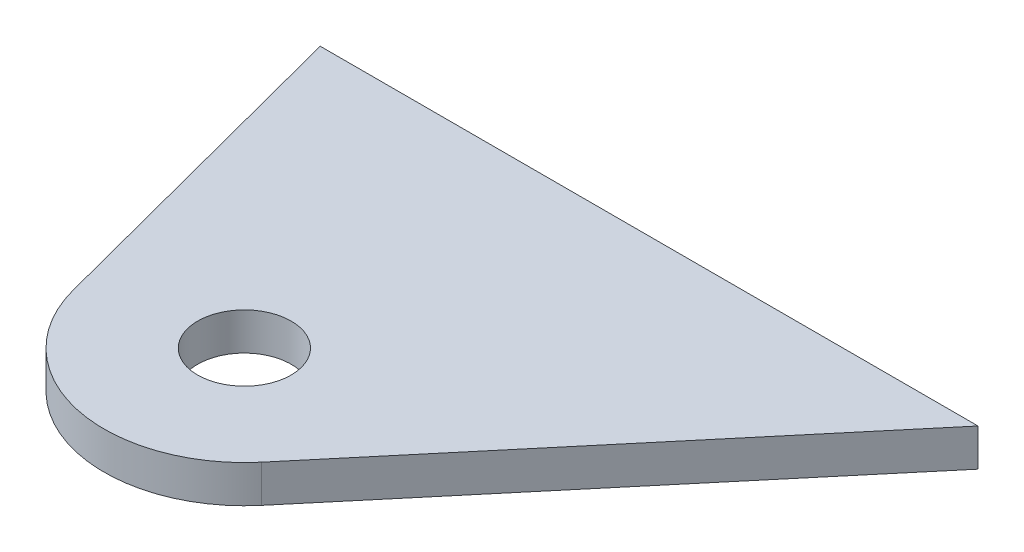
ISO-10303-21;
HEADER;
FILE_DESCRIPTION(('STEP AP214'),'2;1');
FILE_NAME('part.step','',(''),(''),'','','');
FILE_SCHEMA(('AUTOMOTIVE_DESIGN { 1 0 10303 214 1 1 1 1 }'));
ENDSEC;
DATA;
#1=APPLICATION_CONTEXT('core data for automotive mechanical design processes');
#2=APPLICATION_PROTOCOL_DEFINITION('international standard','automotive_design',2000,#1);
#3=PRODUCT_CONTEXT('',#1,'mechanical');
#4=PRODUCT('Part','Part','',(#3));
#5=PRODUCT_RELATED_PRODUCT_CATEGORY('part','',(#4));
#6=PRODUCT_DEFINITION_FORMATION('','',#4);
#7=PRODUCT_DEFINITION_CONTEXT('part definition',#1,'design');
#8=PRODUCT_DEFINITION('design','',#6,#7);
#9=PRODUCT_DEFINITION_SHAPE('','',#8);
#10=(LENGTH_UNIT() NAMED_UNIT(*) SI_UNIT(.MILLI.,.METRE.));
#11=(NAMED_UNIT(*) PLANE_ANGLE_UNIT() SI_UNIT($,.RADIAN.));
#12=(NAMED_UNIT(*) SI_UNIT($,.STERADIAN.) SOLID_ANGLE_UNIT());
#13=UNCERTAINTY_MEASURE_WITH_UNIT(LENGTH_MEASURE(1.E-05),#10,'distance_accuracy_value','');
#14=(GEOMETRIC_REPRESENTATION_CONTEXT(3) GLOBAL_UNCERTAINTY_ASSIGNED_CONTEXT((#13)) GLOBAL_UNIT_ASSIGNED_CONTEXT((#10,
#11,#12)) REPRESENTATION_CONTEXT('',''));
#15=CARTESIAN_POINT('',(0.,0.,0.));
#16=DIRECTION('',(0.,0.,1.));
#17=DIRECTION('',(1.,0.,0.));
#18=AXIS2_PLACEMENT_3D('',#15,#16,#17);
#19=CARTESIAN_POINT('',(-874.000588100556,354.33,-733.373571123904));
#20=DIRECTION('',(0.766044443118978,0.,0.64278760968654));
#21=DIRECTION('',(0.64278760968654,0.,-0.766044443118978));
#22=AXIS2_PLACEMENT_3D('',#19,#20,#21);
#23=PLANE('',#22);
#24=DIRECTION('',(-0.64278760968654,0.,0.766044443118978));
#25=VECTOR('',#24,1.);
#26=CARTESIAN_POINT('',(-874.000588100556,351.79,-733.373571123904));
#27=LINE('',#26,#25);
#28=CARTESIAN_POINT('',(-1621.51549106359,351.79,157.48));
#29=VERTEX_POINT('',#28);
#30=CARTESIAN_POINT('',(-1643.70342667929,351.79,183.922551982264));
#31=VERTEX_POINT('',#30);
#32=EDGE_CURVE('E107',#29,#31,#27,.T.);
#33=ORIENTED_EDGE('',*,*,#32,.F.);
#34=DIRECTION('',(0.,-1.,0.));
#35=VECTOR('',#34,1.);
#36=CARTESIAN_POINT('',(-1621.51549106359,354.33,157.48));
#37=LINE('',#36,#35);
#38=CARTESIAN_POINT('',(-1621.51549106359,354.33,157.48));
#39=VERTEX_POINT('',#38);
#40=EDGE_CURVE('E11',#39,#29,#37,.T.);
#41=ORIENTED_EDGE('',*,*,#40,.F.);
#42=DIRECTION('',(-0.64278760968654,0.,0.766044443118978));
#43=VECTOR('',#42,1.);
#44=CARTESIAN_POINT('',(-874.000588100556,354.33,-733.373571123904));
#45=LINE('',#44,#43);
#46=CARTESIAN_POINT('',(-1643.70342667929,354.33,183.922551982264));
#47=VERTEX_POINT('',#46);
#48=EDGE_CURVE('E97',#39,#47,#45,.T.);
#49=ORIENTED_EDGE('',*,*,#48,.T.);
#50=DIRECTION('',(0.,-1.,0.));
#51=VECTOR('',#50,1.);
#52=CARTESIAN_POINT('',(-1643.70342667929,354.33,183.922551982264));
#53=LINE('',#52,#51);
#54=EDGE_CURVE('E40',#47,#31,#53,.T.);
#55=ORIENTED_EDGE('',*,*,#54,.T.);
#56=EDGE_LOOP('',(#33,#41,#49,#55));
#57=FACE_BOUND('',#56,.T.);
#58=ADVANCED_FACE('F36',(#57),#23,.T.);
#59=CARTESIAN_POINT('',(1.11022302462516E-12,354.33,157.48));
#60=DIRECTION('',(0.,0.,1.));
#61=DIRECTION('',(0.,-1.,0.));
#62=AXIS2_PLACEMENT_3D('',#59,#60,#61);
#63=PLANE('',#62);
#64=DIRECTION('',(-1.,0.,0.));
#65=VECTOR('',#64,1.);
#66=CARTESIAN_POINT('',(1.11022302462516E-12,351.79,157.48));
#67=LINE('',#66,#65);
#68=CARTESIAN_POINT('',(-1666.17201946472,351.79,157.48));
#69=VERTEX_POINT('',#68);
#70=EDGE_CURVE('E113',#29,#69,#67,.T.);
#71=ORIENTED_EDGE('',*,*,#70,.T.);
#72=DIRECTION('',(0.,-1.,0.));
#73=VECTOR('',#72,1.);
#74=CARTESIAN_POINT('',(-1666.17201946472,354.33,157.48));
#75=LINE('',#74,#73);
#76=CARTESIAN_POINT('',(-1666.17201946472,354.33,157.48));
#77=VERTEX_POINT('',#76);
#78=EDGE_CURVE('E46',#77,#69,#75,.T.);
#79=ORIENTED_EDGE('',*,*,#78,.F.);
#80=DIRECTION('',(-1.,0.,0.));
#81=VECTOR('',#80,1.);
#82=CARTESIAN_POINT('',(1.11022302462516E-12,354.33,157.48));
#83=LINE('',#82,#81);
#84=EDGE_CURVE('E90',#39,#77,#83,.T.);
#85=ORIENTED_EDGE('',*,*,#84,.F.);
#86=ORIENTED_EDGE('',*,*,#40,.T.);
#87=EDGE_LOOP('',(#71,#79,#85,#86));
#88=FACE_BOUND('',#87,.T.);
#89=ADVANCED_FACE('F115',(#88),#63,.F.);
#90=CARTESIAN_POINT('',(-1597.70822025968,354.33,418.718179270526));
#91=DIRECTION('',(0.967332028567403,0.,-0.253512813300776));
#92=DIRECTION('',(-0.253512813300776,0.,-0.967332028567403));
#93=AXIS2_PLACEMENT_3D('',#90,#91,#92);
#94=PLANE('',#93);
#95=DIRECTION('',(0.253512813300776,0.,0.967332028567403));
#96=VECTOR('',#95,1.);
#97=CARTESIAN_POINT('',(-1597.70822025968,351.79,418.718179270526));
#98=LINE('',#97,#96);
#99=CARTESIAN_POINT('',(-1660.2138375721,351.79,180.21470954669));
#100=VERTEX_POINT('',#99);
#101=EDGE_CURVE('E71',#69,#100,#98,.T.);
#102=ORIENTED_EDGE('',*,*,#101,.T.);
#103=DIRECTION('',(0.,-1.,0.));
#104=VECTOR('',#103,1.);
#105=CARTESIAN_POINT('',(-1660.2138375721,354.33,180.21470954669));
#106=LINE('',#105,#104);
#107=CARTESIAN_POINT('',(-1660.2138375721,354.33,180.21470954669));
#108=VERTEX_POINT('',#107);
#109=EDGE_CURVE('E94',#108,#100,#106,.T.);
#110=ORIENTED_EDGE('',*,*,#109,.F.);
#111=DIRECTION('',(0.253512813300776,0.,0.967332028567403));
#112=VECTOR('',#111,1.);
#113=CARTESIAN_POINT('',(-1597.70822025968,354.33,418.718179270526));
#114=LINE('',#113,#112);
#115=EDGE_CURVE('E85',#77,#108,#114,.T.);
#116=ORIENTED_EDGE('',*,*,#115,.F.);
#117=ORIENTED_EDGE('',*,*,#78,.T.);
#118=EDGE_LOOP('',(#102,#110,#116,#117));
#119=FACE_BOUND('',#118,.T.);
#120=ADVANCED_FACE('F95',(#119),#94,.F.);
#121=CARTESIAN_POINT('',(-1651.,354.33,177.8));
#122=DIRECTION('',(0.,-1.,0.));
#123=DIRECTION('',(1.,0.,0.));
#124=AXIS2_PLACEMENT_3D('',#121,#122,#123);
#125=CYLINDRICAL_SURFACE('',#124,3.17499999999986);
#126=CARTESIAN_POINT('',(-1651.,354.33,177.8));
#127=DIRECTION('',(0.,-1.,0.));
#128=DIRECTION('',(1.,0.,0.));
#129=AXIS2_PLACEMENT_3D('',#126,#127,#128);
#130=CIRCLE('',#129,3.17499999999986);
#131=CARTESIAN_POINT('',(-1647.825,354.33,177.8));
#132=VERTEX_POINT('',#131);
#133=EDGE_CURVE('E99',#132,#132,#130,.T.);
#134=ORIENTED_EDGE('',*,*,#133,.F.);
#135=EDGE_LOOP('',(#134));
#136=FACE_BOUND('',#135,.T.);
#137=CARTESIAN_POINT('',(-1651.,351.79,177.8));
#138=DIRECTION('',(0.,-1.,0.));
#139=DIRECTION('',(1.,0.,0.));
#140=AXIS2_PLACEMENT_3D('',#137,#138,#139);
#141=CIRCLE('',#140,3.17499999999986);
#142=CARTESIAN_POINT('',(-1647.825,351.79,177.8));
#143=VERTEX_POINT('',#142);
#144=EDGE_CURVE('E104',#143,#143,#141,.T.);
#145=ORIENTED_EDGE('',*,*,#144,.T.);
#146=EDGE_LOOP('',(#145));
#147=FACE_BOUND('',#146,.T.);
#148=ADVANCED_FACE('F38',(#136,#147),#125,.F.);
#149=CARTESIAN_POINT('',(-1651.,354.33,177.8));
#150=DIRECTION('',(0.,-1.,0.));
#151=DIRECTION('',(1.,0.,0.));
#152=AXIS2_PLACEMENT_3D('',#149,#150,#151);
#153=CYLINDRICAL_SURFACE('',#152,9.52499999999994);
#154=CARTESIAN_POINT('',(-1651.,351.79,177.8));
#155=DIRECTION('',(0.,-1.,0.));
#156=DIRECTION('',(1.,0.,0.));
#157=AXIS2_PLACEMENT_3D('',#154,#155,#156);
#158=CIRCLE('',#157,9.52499999999994);
#159=EDGE_CURVE('E110',#31,#100,#158,.T.);
#160=ORIENTED_EDGE('',*,*,#159,.F.);
#161=ORIENTED_EDGE('',*,*,#54,.F.);
#162=CARTESIAN_POINT('',(-1651.,354.33,177.8));
#163=DIRECTION('',(0.,-1.,0.));
#164=DIRECTION('',(1.,0.,0.));
#165=AXIS2_PLACEMENT_3D('',#162,#163,#164);
#166=CIRCLE('',#165,9.52499999999994);
#167=EDGE_CURVE('E89',#47,#108,#166,.T.);
#168=ORIENTED_EDGE('',*,*,#167,.T.);
#169=ORIENTED_EDGE('',*,*,#109,.T.);
#170=EDGE_LOOP('',(#160,#161,#168,#169));
#171=FACE_BOUND('',#170,.T.);
#172=ADVANCED_FACE('F96',(#171),#153,.T.);
#173=CARTESIAN_POINT('',(1.11022302462516E-12,354.33,-2.22044604925031E-13));
#174=DIRECTION('',(0.,-1.,0.));
#175=DIRECTION('',(1.,0.,0.));
#176=AXIS2_PLACEMENT_3D('',#173,#174,#175);
#177=PLANE('',#176);
#178=ORIENTED_EDGE('',*,*,#133,.T.);
#179=EDGE_LOOP('',(#178));
#180=FACE_BOUND('',#179,.T.);
#181=ORIENTED_EDGE('',*,*,#48,.F.);
#182=ORIENTED_EDGE('',*,*,#84,.T.);
#183=ORIENTED_EDGE('',*,*,#115,.T.);
#184=ORIENTED_EDGE('',*,*,#167,.F.);
#185=EDGE_LOOP('',(#181,#182,#183,#184));
#186=FACE_BOUND('',#185,.T.);
#187=ADVANCED_FACE('F88',(#180,#186),#177,.F.);
#188=CARTESIAN_POINT('',(1.11022302462516E-12,351.79,-2.22044604925031E-13));
#189=DIRECTION('',(0.,-1.,0.));
#190=DIRECTION('',(1.,0.,0.));
#191=AXIS2_PLACEMENT_3D('',#188,#189,#190);
#192=PLANE('',#191);
#193=ORIENTED_EDGE('',*,*,#144,.F.);
#194=EDGE_LOOP('',(#193));
#195=FACE_BOUND('',#194,.T.);
#196=ORIENTED_EDGE('',*,*,#32,.T.);
#197=ORIENTED_EDGE('',*,*,#159,.T.);
#198=ORIENTED_EDGE('',*,*,#101,.F.);
#199=ORIENTED_EDGE('',*,*,#70,.F.);
#200=EDGE_LOOP('',(#196,#197,#198,#199));
#201=FACE_BOUND('',#200,.T.);
#202=ADVANCED_FACE('F116',(#195,#201),#192,.T.);
#203=CLOSED_SHELL('',(#58,#89,#120,#148,#172,#187,#202));
#204=MANIFOLD_SOLID_BREP('B2',#203);
#205=ADVANCED_BREP_SHAPE_REPRESENTATION('',(#18,#204),#14);
#206=SHAPE_DEFINITION_REPRESENTATION(#9,#205);
ENDSEC;
END-ISO-10303-21;
